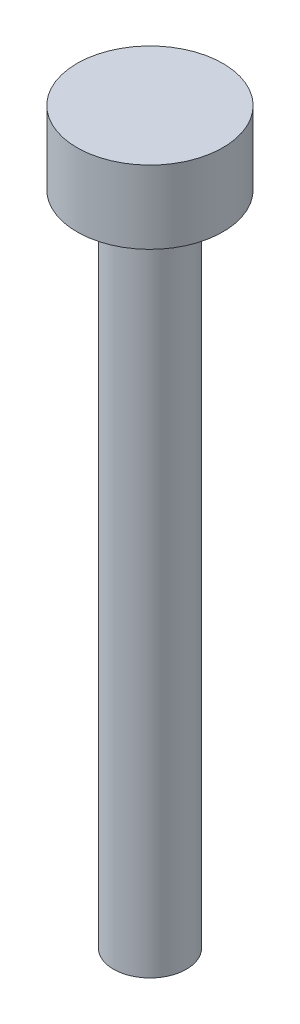
ISO-10303-21;
HEADER;
FILE_DESCRIPTION(('STEP AP214'),'2;1');
FILE_NAME('part.step','',(''),(''),'','','');
FILE_SCHEMA(('AUTOMOTIVE_DESIGN { 1 0 10303 214 1 1 1 1 }'));
ENDSEC;
DATA;
#1=APPLICATION_CONTEXT('core data for automotive mechanical design processes');
#2=APPLICATION_PROTOCOL_DEFINITION('international standard','automotive_design',2000,#1);
#3=PRODUCT_CONTEXT('',#1,'mechanical');
#4=PRODUCT('Part','Part','',(#3));
#5=PRODUCT_RELATED_PRODUCT_CATEGORY('part','',(#4));
#6=PRODUCT_DEFINITION_FORMATION('','',#4);
#7=PRODUCT_DEFINITION_CONTEXT('part definition',#1,'design');
#8=PRODUCT_DEFINITION('design','',#6,#7);
#9=PRODUCT_DEFINITION_SHAPE('','',#8);
#10=(LENGTH_UNIT() NAMED_UNIT(*) SI_UNIT(.MILLI.,.METRE.));
#11=(NAMED_UNIT(*) PLANE_ANGLE_UNIT() SI_UNIT($,.RADIAN.));
#12=(NAMED_UNIT(*) SI_UNIT($,.STERADIAN.) SOLID_ANGLE_UNIT());
#13=UNCERTAINTY_MEASURE_WITH_UNIT(LENGTH_MEASURE(1.E-05),#10,'distance_accuracy_value','');
#14=(GEOMETRIC_REPRESENTATION_CONTEXT(3) GLOBAL_UNCERTAINTY_ASSIGNED_CONTEXT((#13)) GLOBAL_UNIT_ASSIGNED_CONTEXT((#10,
#11,#12)) REPRESENTATION_CONTEXT('',''));
#15=CARTESIAN_POINT('',(0.,0.,0.));
#16=DIRECTION('',(0.,0.,1.));
#17=DIRECTION('',(1.,0.,0.));
#18=AXIS2_PLACEMENT_3D('',#15,#16,#17);
#19=CARTESIAN_POINT('',(1.27,0.,0.));
#20=DIRECTION('',(0.,-1.,0.));
#21=DIRECTION('',(1.,0.,0.));
#22=AXIS2_PLACEMENT_3D('',#19,#20,#21);
#23=PLANE('',#22);
#24=CARTESIAN_POINT('',(1.27,0.,0.));
#25=DIRECTION('',(0.,1.,0.));
#26=DIRECTION('',(-1.,0.,0.));
#27=AXIS2_PLACEMENT_3D('',#24,#25,#26);
#28=CIRCLE('',#27,1.27);
#29=CARTESIAN_POINT('',(0.,0.,0.));
#30=VERTEX_POINT('',#29);
#31=EDGE_CURVE('E10',#30,#30,#28,.T.);
#32=ORIENTED_EDGE('',*,*,#31,.F.);
#33=EDGE_LOOP('',(#32));
#34=FACE_BOUND('',#33,.T.);
#35=ADVANCED_FACE('F31',(#34),#23,.T.);
#36=CARTESIAN_POINT('',(1.27,25.4,0.));
#37=DIRECTION('',(0.,1.,0.));
#38=DIRECTION('',(-1.,0.,0.));
#39=AXIS2_PLACEMENT_3D('',#36,#37,#38);
#40=CYLINDRICAL_SURFACE('',#39,1.27);
#41=ORIENTED_EDGE('',*,*,#31,.T.);
#42=EDGE_LOOP('',(#41));
#43=FACE_BOUND('',#42,.T.);
#44=CARTESIAN_POINT('',(1.27,22.86,0.));
#45=DIRECTION('',(0.,1.,0.));
#46=DIRECTION('',(-1.,0.,0.));
#47=AXIS2_PLACEMENT_3D('',#44,#45,#46);
#48=CIRCLE('',#47,1.27);
#49=CARTESIAN_POINT('',(0.,22.86,0.));
#50=VERTEX_POINT('',#49);
#51=EDGE_CURVE('E37',#50,#50,#48,.T.);
#52=ORIENTED_EDGE('',*,*,#51,.F.);
#53=EDGE_LOOP('',(#52));
#54=FACE_BOUND('',#53,.T.);
#55=ADVANCED_FACE('F63',(#43,#54),#40,.T.);
#56=CARTESIAN_POINT('',(0.,22.86,0.));
#57=DIRECTION('',(0.,-1.,0.));
#58=DIRECTION('',(1.,0.,0.));
#59=AXIS2_PLACEMENT_3D('',#56,#57,#58);
#60=PLANE('',#59);
#61=ORIENTED_EDGE('',*,*,#51,.T.);
#62=EDGE_LOOP('',(#61));
#63=FACE_BOUND('',#62,.T.);
#64=CARTESIAN_POINT('',(1.27,22.86,0.));
#65=DIRECTION('',(0.,1.,0.));
#66=DIRECTION('',(-1.,0.,0.));
#67=AXIS2_PLACEMENT_3D('',#64,#65,#66);
#68=CIRCLE('',#67,2.54);
#69=CARTESIAN_POINT('',(-1.27,22.86,0.));
#70=VERTEX_POINT('',#69);
#71=EDGE_CURVE('E41',#70,#70,#68,.T.);
#72=ORIENTED_EDGE('',*,*,#71,.F.);
#73=EDGE_LOOP('',(#72));
#74=FACE_BOUND('',#73,.T.);
#75=ADVANCED_FACE('F55',(#63,#74),#60,.T.);
#76=CARTESIAN_POINT('',(1.27,25.4,0.));
#77=DIRECTION('',(0.,1.,0.));
#78=DIRECTION('',(-1.,0.,0.));
#79=AXIS2_PLACEMENT_3D('',#76,#77,#78);
#80=CYLINDRICAL_SURFACE('',#79,2.54);
#81=ORIENTED_EDGE('',*,*,#71,.T.);
#82=EDGE_LOOP('',(#81));
#83=FACE_BOUND('',#82,.T.);
#84=CARTESIAN_POINT('',(1.27,25.4,0.));
#85=DIRECTION('',(0.,1.,0.));
#86=DIRECTION('',(-1.,0.,0.));
#87=AXIS2_PLACEMENT_3D('',#84,#85,#86);
#88=CIRCLE('',#87,2.54);
#89=CARTESIAN_POINT('',(-1.27,25.4,0.));
#90=VERTEX_POINT('',#89);
#91=EDGE_CURVE('E45',#90,#90,#88,.T.);
#92=ORIENTED_EDGE('',*,*,#91,.F.);
#93=EDGE_LOOP('',(#92));
#94=FACE_BOUND('',#93,.T.);
#95=ADVANCED_FACE('F53',(#83,#94),#80,.T.);
#96=CARTESIAN_POINT('',(-1.27,25.4,0.));
#97=DIRECTION('',(0.,1.,0.));
#98=DIRECTION('',(-1.,0.,0.));
#99=AXIS2_PLACEMENT_3D('',#96,#97,#98);
#100=PLANE('',#99);
#101=ORIENTED_EDGE('',*,*,#91,.T.);
#102=EDGE_LOOP('',(#101));
#103=FACE_BOUND('',#102,.T.);
#104=ADVANCED_FACE('F51',(#103),#100,.T.);
#105=CLOSED_SHELL('',(#35,#55,#75,#95,#104));
#106=MANIFOLD_SOLID_BREP('B2',#105);
#107=ADVANCED_BREP_SHAPE_REPRESENTATION('',(#18,#106),#14);
#108=SHAPE_DEFINITION_REPRESENTATION(#9,#107);
ENDSEC;
END-ISO-10303-21;
